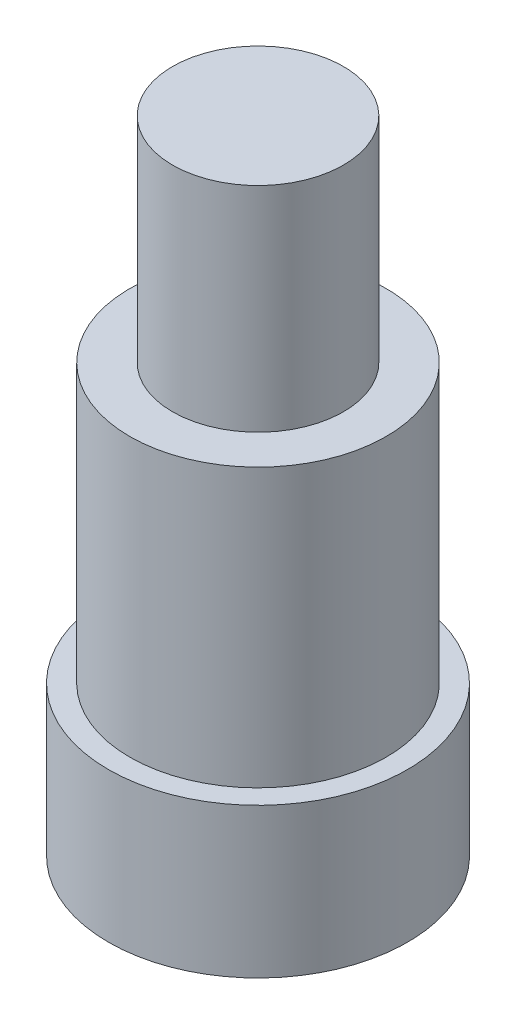
ISO-10303-21;
HEADER;
FILE_DESCRIPTION(('STEP AP214'),'2;1');
FILE_NAME('part.step','',(''),(''),'','','');
FILE_SCHEMA(('AUTOMOTIVE_DESIGN { 1 0 10303 214 1 1 1 1 }'));
ENDSEC;
DATA;
#1=APPLICATION_CONTEXT('core data for automotive mechanical design processes');
#2=APPLICATION_PROTOCOL_DEFINITION('international standard','automotive_design',2000,#1);
#3=PRODUCT_CONTEXT('',#1,'mechanical');
#4=PRODUCT('Part','Part','',(#3));
#5=PRODUCT_RELATED_PRODUCT_CATEGORY('part','',(#4));
#6=PRODUCT_DEFINITION_FORMATION('','',#4);
#7=PRODUCT_DEFINITION_CONTEXT('part definition',#1,'design');
#8=PRODUCT_DEFINITION('design','',#6,#7);
#9=PRODUCT_DEFINITION_SHAPE('','',#8);
#10=(LENGTH_UNIT() NAMED_UNIT(*) SI_UNIT(.MILLI.,.METRE.));
#11=(NAMED_UNIT(*) PLANE_ANGLE_UNIT() SI_UNIT($,.RADIAN.));
#12=(NAMED_UNIT(*) SI_UNIT($,.STERADIAN.) SOLID_ANGLE_UNIT());
#13=UNCERTAINTY_MEASURE_WITH_UNIT(LENGTH_MEASURE(1.E-05),#10,'distance_accuracy_value','');
#14=(GEOMETRIC_REPRESENTATION_CONTEXT(3) GLOBAL_UNCERTAINTY_ASSIGNED_CONTEXT((#13)) GLOBAL_UNIT_ASSIGNED_CONTEXT((#10,
#11,#12)) REPRESENTATION_CONTEXT('',''));
#15=CARTESIAN_POINT('',(0.,0.,0.));
#16=DIRECTION('',(0.,0.,1.));
#17=DIRECTION('',(1.,0.,0.));
#18=AXIS2_PLACEMENT_3D('',#15,#16,#17);
#19=CARTESIAN_POINT('',(0.,7.,0.));
#20=DIRECTION('',(0.,-1.,0.));
#21=DIRECTION('',(0.,0.,-1.));
#22=AXIS2_PLACEMENT_3D('',#19,#20,#21);
#23=CYLINDRICAL_SURFACE('',#22,7.);
#24=CARTESIAN_POINT('',(0.,7.,0.));
#25=DIRECTION('',(0.,1.,0.));
#26=DIRECTION('',(0.,0.,1.));
#27=AXIS2_PLACEMENT_3D('',#24,#25,#26);
#28=CIRCLE('',#27,7.);
#29=CARTESIAN_POINT('',(0.,7.,7.));
#30=VERTEX_POINT('',#29);
#31=EDGE_CURVE('E48',#30,#30,#28,.T.);
#32=ORIENTED_EDGE('',*,*,#31,.F.);
#33=EDGE_LOOP('',(#32));
#34=FACE_BOUND('',#33,.T.);
#35=CARTESIAN_POINT('',(0.,0.,0.));
#36=DIRECTION('',(0.,1.,0.));
#37=DIRECTION('',(0.,0.,1.));
#38=AXIS2_PLACEMENT_3D('',#35,#36,#37);
#39=CIRCLE('',#38,7.);
#40=CARTESIAN_POINT('',(0.,0.,7.));
#41=VERTEX_POINT('',#40);
#42=EDGE_CURVE('E39',#41,#41,#39,.T.);
#43=ORIENTED_EDGE('',*,*,#42,.T.);
#44=EDGE_LOOP('',(#43));
#45=FACE_BOUND('',#44,.T.);
#46=ADVANCED_FACE('F36',(#34,#45),#23,.T.);
#47=CARTESIAN_POINT('',(0.,7.,0.));
#48=DIRECTION('',(0.,1.,0.));
#49=DIRECTION('',(0.,0.,1.));
#50=AXIS2_PLACEMENT_3D('',#47,#48,#49);
#51=PLANE('',#50);
#52=CARTESIAN_POINT('',(0.,7.,0.));
#53=DIRECTION('',(0.,1.,0.));
#54=DIRECTION('',(0.,0.,1.));
#55=AXIS2_PLACEMENT_3D('',#52,#53,#54);
#56=CIRCLE('',#55,6.);
#57=CARTESIAN_POINT('',(0.,7.,6.));
#58=VERTEX_POINT('',#57);
#59=EDGE_CURVE('E43',#58,#58,#56,.T.);
#60=ORIENTED_EDGE('',*,*,#59,.F.);
#61=EDGE_LOOP('',(#60));
#62=FACE_BOUND('',#61,.T.);
#63=ORIENTED_EDGE('',*,*,#31,.T.);
#64=EDGE_LOOP('',(#63));
#65=FACE_BOUND('',#64,.T.);
#66=ADVANCED_FACE('F65',(#62,#65),#51,.T.);
#67=CARTESIAN_POINT('',(0.,0.,0.));
#68=DIRECTION('',(0.,1.,0.));
#69=DIRECTION('',(0.,0.,1.));
#70=AXIS2_PLACEMENT_3D('',#67,#68,#69);
#71=PLANE('',#70);
#72=ORIENTED_EDGE('',*,*,#42,.F.);
#73=EDGE_LOOP('',(#72));
#74=FACE_BOUND('',#73,.T.);
#75=ADVANCED_FACE('F62',(#74),#71,.F.);
#76=CARTESIAN_POINT('',(0.,20.,0.));
#77=DIRECTION('',(0.,-1.,0.));
#78=DIRECTION('',(0.,0.,-1.));
#79=AXIS2_PLACEMENT_3D('',#76,#77,#78);
#80=CYLINDRICAL_SURFACE('',#79,6.);
#81=CARTESIAN_POINT('',(0.,20.,0.));
#82=DIRECTION('',(0.,1.,0.));
#83=DIRECTION('',(0.,0.,1.));
#84=AXIS2_PLACEMENT_3D('',#81,#82,#83);
#85=CIRCLE('',#84,6.);
#86=CARTESIAN_POINT('',(0.,20.,6.));
#87=VERTEX_POINT('',#86);
#88=EDGE_CURVE('E53',#87,#87,#85,.T.);
#89=ORIENTED_EDGE('',*,*,#88,.F.);
#90=EDGE_LOOP('',(#89));
#91=FACE_BOUND('',#90,.T.);
#92=ORIENTED_EDGE('',*,*,#59,.T.);
#93=EDGE_LOOP('',(#92));
#94=FACE_BOUND('',#93,.T.);
#95=ADVANCED_FACE('F64',(#91,#94),#80,.T.);
#96=CARTESIAN_POINT('',(0.,20.,0.));
#97=DIRECTION('',(0.,1.,0.));
#98=DIRECTION('',(0.,0.,1.));
#99=AXIS2_PLACEMENT_3D('',#96,#97,#98);
#100=PLANE('',#99);
#101=CARTESIAN_POINT('',(0.,20.,0.));
#102=DIRECTION('',(0.,1.,0.));
#103=DIRECTION('',(0.,0.,1.));
#104=AXIS2_PLACEMENT_3D('',#101,#102,#103);
#105=CIRCLE('',#104,4.);
#106=CARTESIAN_POINT('',(0.,20.,4.));
#107=VERTEX_POINT('',#106);
#108=EDGE_CURVE('E10',#107,#107,#105,.T.);
#109=ORIENTED_EDGE('',*,*,#108,.F.);
#110=EDGE_LOOP('',(#109));
#111=FACE_BOUND('',#110,.T.);
#112=ORIENTED_EDGE('',*,*,#88,.T.);
#113=EDGE_LOOP('',(#112));
#114=FACE_BOUND('',#113,.T.);
#115=ADVANCED_FACE('F70',(#111,#114),#100,.T.);
#116=CARTESIAN_POINT('',(0.,30.,0.));
#117=DIRECTION('',(0.,-1.,0.));
#118=DIRECTION('',(0.,0.,-1.));
#119=AXIS2_PLACEMENT_3D('',#116,#117,#118);
#120=CYLINDRICAL_SURFACE('',#119,4.);
#121=CARTESIAN_POINT('',(0.,30.,0.));
#122=DIRECTION('',(0.,1.,0.));
#123=DIRECTION('',(0.,0.,1.));
#124=AXIS2_PLACEMENT_3D('',#121,#122,#123);
#125=CIRCLE('',#124,4.);
#126=CARTESIAN_POINT('',(0.,30.,4.));
#127=VERTEX_POINT('',#126);
#128=EDGE_CURVE('E52',#127,#127,#125,.T.);
#129=ORIENTED_EDGE('',*,*,#128,.F.);
#130=EDGE_LOOP('',(#129));
#131=FACE_BOUND('',#130,.T.);
#132=ORIENTED_EDGE('',*,*,#108,.T.);
#133=EDGE_LOOP('',(#132));
#134=FACE_BOUND('',#133,.T.);
#135=ADVANCED_FACE('F100',(#131,#134),#120,.T.);
#136=CARTESIAN_POINT('',(0.,30.,0.));
#137=DIRECTION('',(0.,1.,0.));
#138=DIRECTION('',(0.,0.,1.));
#139=AXIS2_PLACEMENT_3D('',#136,#137,#138);
#140=PLANE('',#139);
#141=ORIENTED_EDGE('',*,*,#128,.T.);
#142=EDGE_LOOP('',(#141));
#143=FACE_BOUND('',#142,.T.);
#144=ADVANCED_FACE('F110',(#143),#140,.T.);
#145=CLOSED_SHELL('',(#46,#66,#75,#95,#115,#135,#144));
#146=MANIFOLD_SOLID_BREP('B2',#145);
#147=ADVANCED_BREP_SHAPE_REPRESENTATION('',(#18,#146),#14);
#148=SHAPE_DEFINITION_REPRESENTATION(#9,#147);
ENDSEC;
END-ISO-10303-21;
